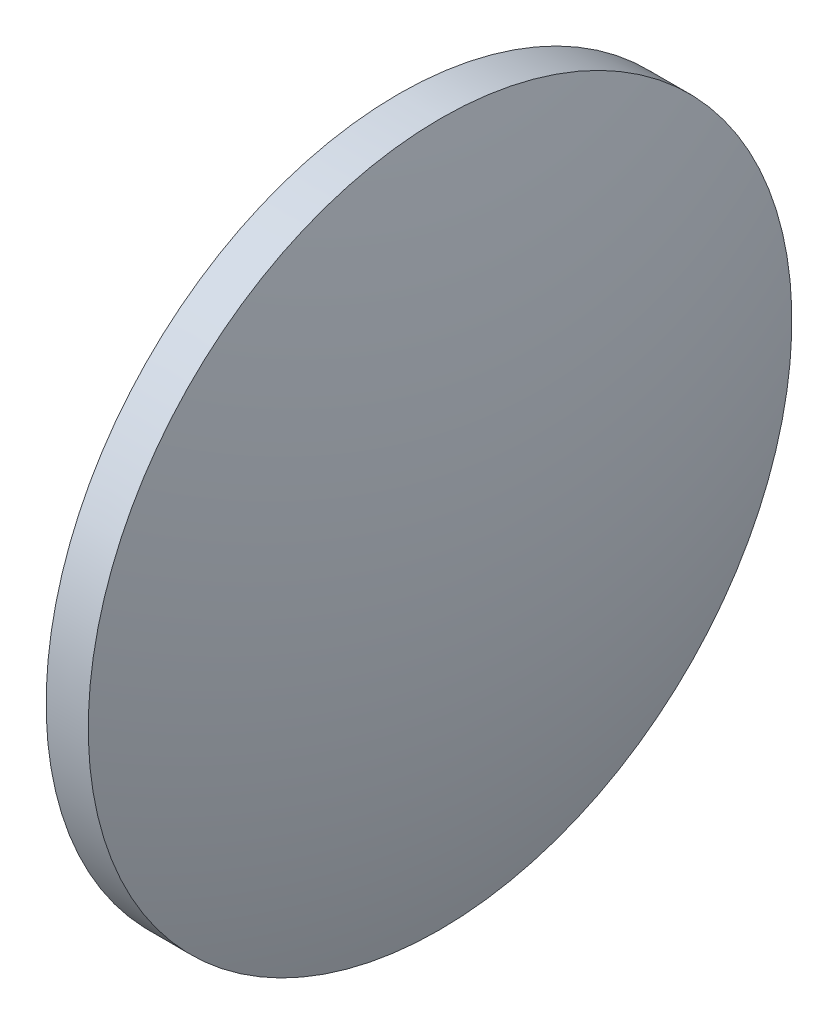
ISO-10303-21;
HEADER;
FILE_DESCRIPTION(('STEP AP214'),'2;1');
FILE_NAME('part.step','',(''),(''),'','','');
FILE_SCHEMA(('AUTOMOTIVE_DESIGN { 1 0 10303 214 1 1 1 1 }'));
ENDSEC;
DATA;
#1=APPLICATION_CONTEXT('core data for automotive mechanical design processes');
#2=APPLICATION_PROTOCOL_DEFINITION('international standard','automotive_design',2000,#1);
#3=PRODUCT_CONTEXT('',#1,'mechanical');
#4=PRODUCT('Part','Part','',(#3));
#5=PRODUCT_RELATED_PRODUCT_CATEGORY('part','',(#4));
#6=PRODUCT_DEFINITION_FORMATION('','',#4);
#7=PRODUCT_DEFINITION_CONTEXT('part definition',#1,'design');
#8=PRODUCT_DEFINITION('design','',#6,#7);
#9=PRODUCT_DEFINITION_SHAPE('','',#8);
#10=(LENGTH_UNIT() NAMED_UNIT(*) SI_UNIT(.MILLI.,.METRE.));
#11=(NAMED_UNIT(*) PLANE_ANGLE_UNIT() SI_UNIT($,.RADIAN.));
#12=(NAMED_UNIT(*) SI_UNIT($,.STERADIAN.) SOLID_ANGLE_UNIT());
#13=UNCERTAINTY_MEASURE_WITH_UNIT(LENGTH_MEASURE(1.E-05),#10,'distance_accuracy_value','');
#14=(GEOMETRIC_REPRESENTATION_CONTEXT(3) GLOBAL_UNCERTAINTY_ASSIGNED_CONTEXT((#13)) GLOBAL_UNIT_ASSIGNED_CONTEXT((#10,
#11,#12)) REPRESENTATION_CONTEXT('',''));
#15=CARTESIAN_POINT('',(0.,0.,0.));
#16=DIRECTION('',(0.,0.,1.));
#17=DIRECTION('',(1.,0.,0.));
#18=AXIS2_PLACEMENT_3D('',#15,#16,#17);
#19=CARTESIAN_POINT('',(377.783880583903,-35.8646627814748,0.));
#20=DIRECTION('',(0.,0.,-1.));
#21=DIRECTION('',(-0.00194244466169402,-0.999998113452589,0.));
#22=AXIS2_PLACEMENT_3D('',#19,#20,#21);
#23=CIRCLE('',#22,82.6843540051679);
#24=TRIMMED_CURVE('',#23,(PARAMETER_VALUE(-1.56901527321049)),
(PARAMETER_VALUE(1.56901527321049)),.T.,.PARAMETER.);
#25=CARTESIAN_POINT('',(377.783594529426,-36.0119276908691,0.));
#26=DIRECTION('',(-0.999998113452589,0.00194244466169402,0.));
#27=AXIS1_PLACEMENT('',#25,#26);
#28=SURFACE_OF_REVOLUTION('',#24,#27);
#29=CARTESIAN_POINT('',(456.549090135914,-36.1649255959734,0.));
#30=DIRECTION('',(-0.999998113452589,0.00194244466169402,0.));
#31=DIRECTION('',(-0.00194244466169402,-0.999998113452589,0.));
#32=AXIS2_PLACEMENT_3D('',#29,#30,#31);
#33=CIRCLE('',#32,25.0057801702998);
#34=CARTESIAN_POINT('',(456.500517791711,-61.1706585916834,0.));
#35=VERTEX_POINT('',#34);
#36=EDGE_CURVE('E11',#35,#35,#33,.T.);
#37=ORIENTED_EDGE('',*,*,#36,.F.);
#38=EDGE_LOOP('',(#37));
#39=FACE_BOUND('',#38,.T.);
#40=CARTESIAN_POINT('',(460.467661403258,-36.1725372181729,0.));
#41=VERTEX_POINT('',#40);
#42=VERTEX_LOOP('',#41);
#43=FACE_BOUND('',#42,.T.);
#44=ADVANCED_FACE('F37',(#39,#43),#28,.T.);
#45=CARTESIAN_POINT('',(456.549090135914,-36.1649255959734,0.));
#46=DIRECTION('',(0.999998113452589,-0.00194244466169402,0.));
#47=DIRECTION('',(0.00194244466169402,0.999998113452589,0.));
#48=AXIS2_PLACEMENT_3D('',#45,#46,#47);
#49=CONICAL_SURFACE('',#48,25.0057801702998,0.00194244588320092);
#50=CARTESIAN_POINT('',(453.549101455188,-36.1590982729819,0.));
#51=DIRECTION('',(-0.999998113452589,0.00194244466169402,0.));
#52=DIRECTION('',(-0.00194244466169402,-0.999998113452589,0.));
#53=AXIS2_PLACEMENT_3D('',#50,#51,#52);
#54=CIRCLE('',#53,24.9999528363147);
#55=CARTESIAN_POINT('',(453.500540430259,-61.1590039457003,0.));
#56=VERTEX_POINT('',#55);
#57=EDGE_CURVE('E44',#56,#56,#54,.T.);
#58=ORIENTED_EDGE('',*,*,#57,.F.);
#59=EDGE_LOOP('',(#58));
#60=FACE_BOUND('',#59,.T.);
#61=ORIENTED_EDGE('',*,*,#36,.T.);
#62=EDGE_LOOP('',(#61));
#63=FACE_BOUND('',#62,.T.);
#64=ADVANCED_FACE('F53',(#60,#63),#49,.T.);
#65=CARTESIAN_POINT('',(453.549101455188,-36.1590982729819,0.));
#66=DIRECTION('',(-0.999998113452589,0.00194244466169402,0.));
#67=DIRECTION('',(-0.00194244466169402,-0.999998113452589,0.));
#68=AXIS2_PLACEMENT_3D('',#65,#66,#67);
#69=CONICAL_SURFACE('',#68,24.9999528363147,1.5688538809117);
#70=CARTESIAN_POINT('',(453.597662480118,-36.1591926002635,0.));
#71=VERTEX_POINT('',#70);
#72=VERTEX_LOOP('',#71);
#73=FACE_BOUND('',#72,.T.);
#74=ORIENTED_EDGE('',*,*,#57,.T.);
#75=EDGE_LOOP('',(#74));
#76=FACE_BOUND('',#75,.T.);
#77=ADVANCED_FACE('F50',(#73,#76),#69,.F.);
#78=CLOSED_SHELL('',(#44,#64,#77));
#79=MANIFOLD_SOLID_BREP('B2',#78);
#80=ADVANCED_BREP_SHAPE_REPRESENTATION('',(#18,#79),#14);
#81=SHAPE_DEFINITION_REPRESENTATION(#9,#80);
ENDSEC;
END-ISO-10303-21;
